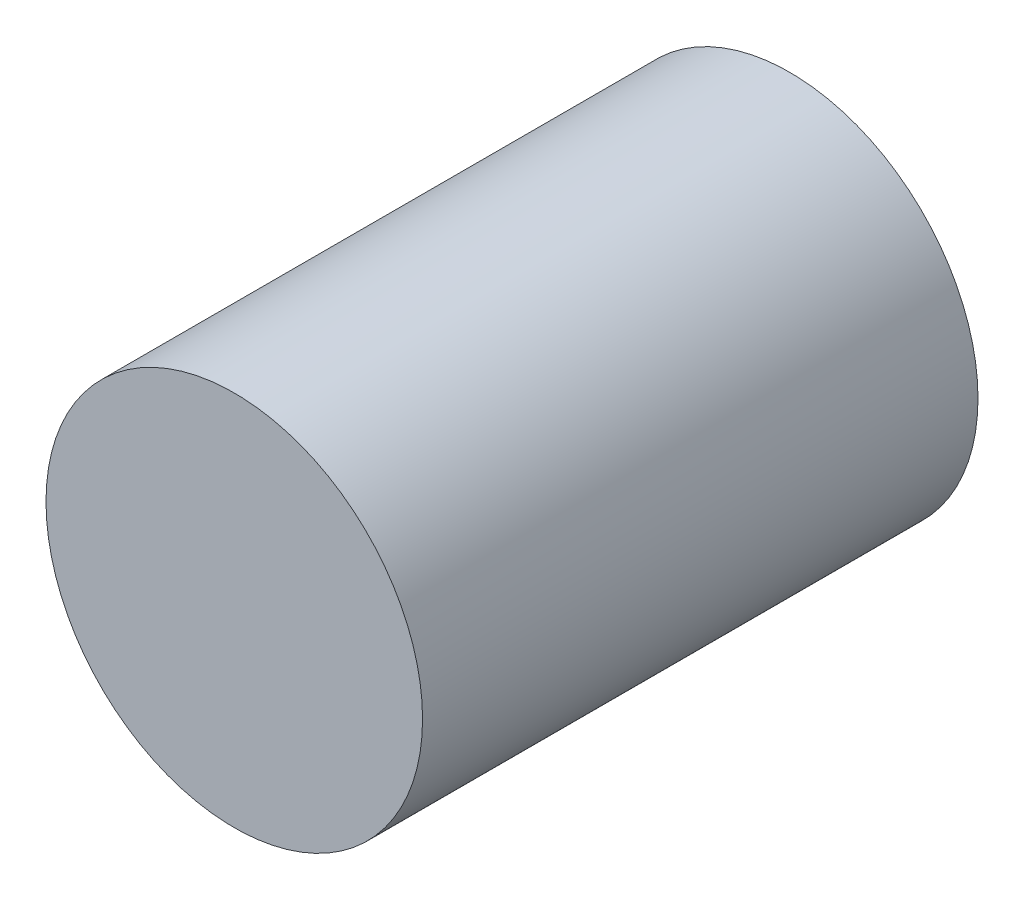
ISO-10303-21;
HEADER;
FILE_DESCRIPTION(('STEP AP214'),'2;1');
FILE_NAME('part.step','',(''),(''),'','','');
FILE_SCHEMA(('AUTOMOTIVE_DESIGN { 1 0 10303 214 1 1 1 1 }'));
ENDSEC;
DATA;
#1=APPLICATION_CONTEXT('core data for automotive mechanical design processes');
#2=APPLICATION_PROTOCOL_DEFINITION('international standard','automotive_design',2000,#1);
#3=PRODUCT_CONTEXT('',#1,'mechanical');
#4=PRODUCT('Part','Part','',(#3));
#5=PRODUCT_RELATED_PRODUCT_CATEGORY('part','',(#4));
#6=PRODUCT_DEFINITION_FORMATION('','',#4);
#7=PRODUCT_DEFINITION_CONTEXT('part definition',#1,'design');
#8=PRODUCT_DEFINITION('design','',#6,#7);
#9=PRODUCT_DEFINITION_SHAPE('','',#8);
#10=(LENGTH_UNIT() NAMED_UNIT(*) SI_UNIT(.MILLI.,.METRE.));
#11=(NAMED_UNIT(*) PLANE_ANGLE_UNIT() SI_UNIT($,.RADIAN.));
#12=(NAMED_UNIT(*) SI_UNIT($,.STERADIAN.) SOLID_ANGLE_UNIT());
#13=UNCERTAINTY_MEASURE_WITH_UNIT(LENGTH_MEASURE(1.E-05),#10,'distance_accuracy_value','');
#14=(GEOMETRIC_REPRESENTATION_CONTEXT(3) GLOBAL_UNCERTAINTY_ASSIGNED_CONTEXT((#13)) GLOBAL_UNIT_ASSIGNED_CONTEXT((#10,
#11,#12)) REPRESENTATION_CONTEXT('',''));
#15=CARTESIAN_POINT('',(0.,0.,0.));
#16=DIRECTION('',(0.,0.,1.));
#17=DIRECTION('',(1.,0.,0.));
#18=AXIS2_PLACEMENT_3D('',#15,#16,#17);
#19=CARTESIAN_POINT('',(0.,0.,90.));
#20=DIRECTION('',(0.,0.,-1.));
#21=DIRECTION('',(-1.,0.,0.));
#22=AXIS2_PLACEMENT_3D('',#19,#20,#21);
#23=CYLINDRICAL_SURFACE('',#22,30.5076024905117);
#24=CARTESIAN_POINT('',(0.,0.,90.));
#25=DIRECTION('',(0.,0.,1.));
#26=DIRECTION('',(1.,0.,0.));
#27=AXIS2_PLACEMENT_3D('',#24,#25,#26);
#28=CIRCLE('',#27,30.5076024905117);
#29=CARTESIAN_POINT('',(30.5076024905117,0.,90.));
#30=VERTEX_POINT('',#29);
#31=EDGE_CURVE('E10',#30,#30,#28,.T.);
#32=ORIENTED_EDGE('',*,*,#31,.F.);
#33=EDGE_LOOP('',(#32));
#34=FACE_BOUND('',#33,.T.);
#35=CARTESIAN_POINT('',(0.,0.,0.));
#36=DIRECTION('',(0.,0.,1.));
#37=DIRECTION('',(1.,0.,0.));
#38=AXIS2_PLACEMENT_3D('',#35,#36,#37);
#39=CIRCLE('',#38,30.5076024905117);
#40=CARTESIAN_POINT('',(30.5076024905117,0.,0.));
#41=VERTEX_POINT('',#40);
#42=EDGE_CURVE('E38',#41,#41,#39,.T.);
#43=ORIENTED_EDGE('',*,*,#42,.T.);
#44=EDGE_LOOP('',(#43));
#45=FACE_BOUND('',#44,.T.);
#46=ADVANCED_FACE('F35',(#34,#45),#23,.T.);
#47=CARTESIAN_POINT('',(0.,0.,90.));
#48=DIRECTION('',(0.,0.,1.));
#49=DIRECTION('',(1.,0.,0.));
#50=AXIS2_PLACEMENT_3D('',#47,#48,#49);
#51=PLANE('',#50);
#52=ORIENTED_EDGE('',*,*,#31,.T.);
#53=EDGE_LOOP('',(#52));
#54=FACE_BOUND('',#53,.T.);
#55=ADVANCED_FACE('F50',(#54),#51,.T.);
#56=CARTESIAN_POINT('',(0.,0.,0.));
#57=DIRECTION('',(0.,0.,1.));
#58=DIRECTION('',(1.,0.,0.));
#59=AXIS2_PLACEMENT_3D('',#56,#57,#58);
#60=PLANE('',#59);
#61=ORIENTED_EDGE('',*,*,#42,.F.);
#62=EDGE_LOOP('',(#61));
#63=FACE_BOUND('',#62,.T.);
#64=ADVANCED_FACE('F48',(#63),#60,.F.);
#65=CLOSED_SHELL('',(#46,#55,#64));
#66=MANIFOLD_SOLID_BREP('B2',#65);
#67=ADVANCED_BREP_SHAPE_REPRESENTATION('',(#18,#66),#14);
#68=SHAPE_DEFINITION_REPRESENTATION(#9,#67);
ENDSEC;
END-ISO-10303-21;
